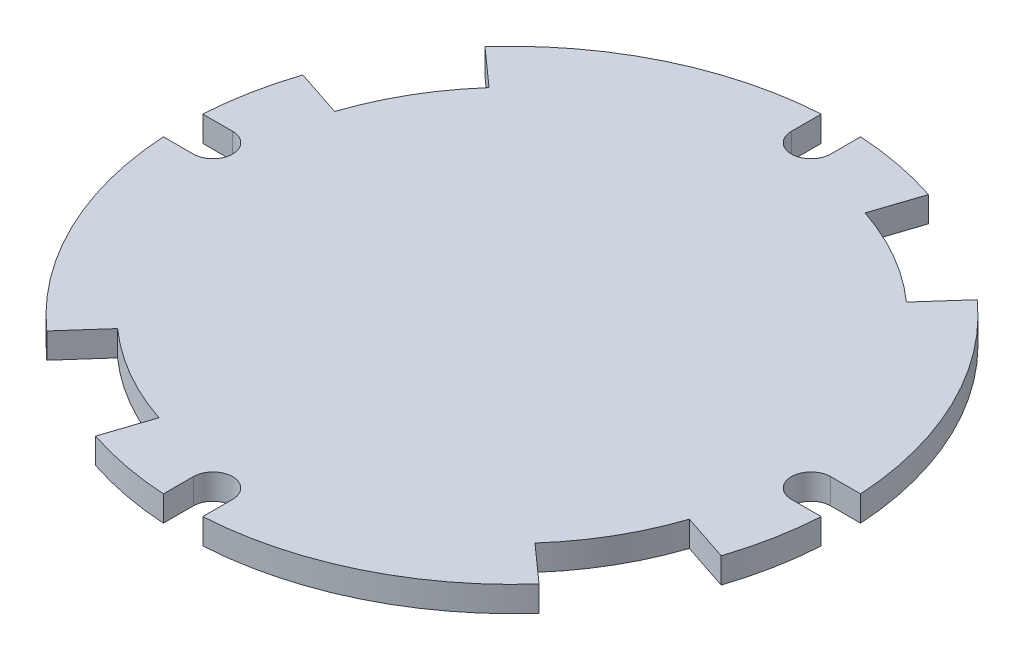
ISO-10303-21;
HEADER;
FILE_DESCRIPTION(('STEP AP214'),'2;1');
FILE_NAME('part.step','',(''),(''),'','','');
FILE_SCHEMA(('AUTOMOTIVE_DESIGN { 1 0 10303 214 1 1 1 1 }'));
ENDSEC;
DATA;
#1=APPLICATION_CONTEXT('core data for automotive mechanical design processes');
#2=APPLICATION_PROTOCOL_DEFINITION('international standard','automotive_design',2000,#1);
#3=PRODUCT_CONTEXT('',#1,'mechanical');
#4=PRODUCT('Part','Part','',(#3));
#5=PRODUCT_RELATED_PRODUCT_CATEGORY('part','',(#4));
#6=PRODUCT_DEFINITION_FORMATION('','',#4);
#7=PRODUCT_DEFINITION_CONTEXT('part definition',#1,'design');
#8=PRODUCT_DEFINITION('design','',#6,#7);
#9=PRODUCT_DEFINITION_SHAPE('','',#8);
#10=(LENGTH_UNIT() NAMED_UNIT(*) SI_UNIT(.MILLI.,.METRE.));
#11=(NAMED_UNIT(*) PLANE_ANGLE_UNIT() SI_UNIT($,.RADIAN.));
#12=(NAMED_UNIT(*) SI_UNIT($,.STERADIAN.) SOLID_ANGLE_UNIT());
#13=UNCERTAINTY_MEASURE_WITH_UNIT(LENGTH_MEASURE(1.E-05),#10,'distance_accuracy_value','');
#14=(GEOMETRIC_REPRESENTATION_CONTEXT(3) GLOBAL_UNCERTAINTY_ASSIGNED_CONTEXT((#13)) GLOBAL_UNIT_ASSIGNED_CONTEXT((#10,
#11,#12)) REPRESENTATION_CONTEXT('',''));
#15=CARTESIAN_POINT('',(0.,0.,0.));
#16=DIRECTION('',(0.,0.,1.));
#17=DIRECTION('',(1.,0.,0.));
#18=AXIS2_PLACEMENT_3D('',#15,#16,#17);
#19=CARTESIAN_POINT('',(0.,2.,0.));
#20=DIRECTION('',(0.,-1.,0.));
#21=DIRECTION('',(0.,0.,-1.));
#22=AXIS2_PLACEMENT_3D('',#19,#20,#21);
#23=CYLINDRICAL_SURFACE('',#22,25.95);
#24=DIRECTION('',(0.,-1.,0.));
#25=VECTOR('',#24,1.);
#26=CARTESIAN_POINT('',(25.9036676939772,2.,-1.55000000000027));
#27=LINE('',#26,#25);
#28=CARTESIAN_POINT('',(25.9036676939772,2.,-1.55000000000027));
#29=VERTEX_POINT('',#28);
#30=CARTESIAN_POINT('',(25.9036676939772,0.,-1.55000000000027));
#31=VERTEX_POINT('',#30);
#32=EDGE_CURVE('E406',#29,#31,#27,.T.);
#33=ORIENTED_EDGE('',*,*,#32,.T.);
#34=CARTESIAN_POINT('',(0.,0.,0.));
#35=DIRECTION('',(0.,1.,0.));
#36=DIRECTION('',(0.,0.,1.));
#37=AXIS2_PLACEMENT_3D('',#34,#35,#36);
#38=CIRCLE('',#37,25.95);
#39=CARTESIAN_POINT('',(17.2533245205966,0.,-19.3836346691476));
#40=VERTEX_POINT('',#39);
#41=EDGE_CURVE('E313',#31,#40,#38,.T.);
#42=ORIENTED_EDGE('',*,*,#41,.T.);
#43=DIRECTION('',(0.,-1.,0.));
#44=VECTOR('',#43,1.);
#45=CARTESIAN_POINT('',(17.2533245205966,2.,-19.3836346691476));
#46=LINE('',#45,#44);
#47=CARTESIAN_POINT('',(17.2533245205966,2.,-19.3836346691476));
#48=VERTEX_POINT('',#47);
#49=EDGE_CURVE('E290',#48,#40,#46,.T.);
#50=ORIENTED_EDGE('',*,*,#49,.F.);
#51=CARTESIAN_POINT('',(0.,2.,0.));
#52=DIRECTION('',(0.,1.,0.));
#53=DIRECTION('',(0.,0.,1.));
#54=AXIS2_PLACEMENT_3D('',#51,#52,#53);
#55=CIRCLE('',#54,25.95);
#56=EDGE_CURVE('E276',#29,#48,#55,.T.);
#57=ORIENTED_EDGE('',*,*,#56,.F.);
#58=EDGE_LOOP('',(#33,#42,#50,#57));
#59=FACE_BOUND('',#58,.T.);
#60=ADVANCED_FACE('F38',(#59),#23,.T.);
#61=DIRECTION('',(0.,-1.,0.));
#62=VECTOR('',#61,1.);
#63=CARTESIAN_POINT('',(25.9036676939773,2.,1.54999999999973));
#64=LINE('',#63,#62);
#65=CARTESIAN_POINT('',(25.9036676939773,2.,1.54999999999973));
#66=VERTEX_POINT('',#65);
#67=CARTESIAN_POINT('',(25.9036676939773,0.,1.54999999999973));
#68=VERTEX_POINT('',#67);
#69=EDGE_CURVE('E54',#66,#68,#64,.T.);
#70=ORIENTED_EDGE('',*,*,#69,.F.);
#71=CARTESIAN_POINT('',(24.6336346691476,2.,8.16005778085971));
#72=VERTEX_POINT('',#71);
#73=EDGE_CURVE('E269',#72,#66,#55,.T.);
#74=ORIENTED_EDGE('',*,*,#73,.F.);
#75=DIRECTION('',(0.,-1.,0.));
#76=VECTOR('',#75,1.);
#77=CARTESIAN_POINT('',(24.6336346691476,2.,8.16005778085971));
#78=LINE('',#77,#76);
#79=CARTESIAN_POINT('',(24.6336346691476,0.,8.16005778085971));
#80=VERTEX_POINT('',#79);
#81=EDGE_CURVE('E249',#72,#80,#78,.T.);
#82=ORIENTED_EDGE('',*,*,#81,.T.);
#83=EDGE_CURVE('E476',#80,#68,#38,.T.);
#84=ORIENTED_EDGE('',*,*,#83,.T.);
#85=EDGE_LOOP('',(#70,#74,#82,#84));
#86=FACE_BOUND('',#85,.T.);
#87=ADVANCED_FACE('F274',(#86),#23,.T.);
#88=DIRECTION('',(0.,-1.,0.));
#89=VECTOR('',#88,1.);
#90=CARTESIAN_POINT('',(-8.16005778085997,2.,24.6336346691475));
#91=LINE('',#90,#89);
#92=CARTESIAN_POINT('',(-8.16005778085997,2.,24.6336346691475));
#93=VERTEX_POINT('',#92);
#94=CARTESIAN_POINT('',(-8.16005778085997,0.,24.6336346691475));
#95=VERTEX_POINT('',#94);
#96=EDGE_CURVE('E379',#93,#95,#91,.T.);
#97=ORIENTED_EDGE('',*,*,#96,.T.);
#98=CARTESIAN_POINT('',(-1.55,0.,25.9036676939772));
#99=VERTEX_POINT('',#98);
#100=EDGE_CURVE('E475',#95,#99,#38,.T.);
#101=ORIENTED_EDGE('',*,*,#100,.T.);
#102=DIRECTION('',(0.,-1.,0.));
#103=VECTOR('',#102,1.);
#104=CARTESIAN_POINT('',(-1.55,2.,25.9036676939772));
#105=LINE('',#104,#103);
#106=CARTESIAN_POINT('',(-1.55,2.,25.9036676939772));
#107=VERTEX_POINT('',#106);
#108=EDGE_CURVE('E366',#107,#99,#105,.T.);
#109=ORIENTED_EDGE('',*,*,#108,.F.);
#110=EDGE_CURVE('E278',#93,#107,#55,.T.);
#111=ORIENTED_EDGE('',*,*,#110,.F.);
#112=EDGE_LOOP('',(#97,#101,#109,#111));
#113=FACE_BOUND('',#112,.T.);
#114=ADVANCED_FACE('F517',(#113),#23,.T.);
#115=DIRECTION('',(0.,-1.,0.));
#116=VECTOR('',#115,1.);
#117=CARTESIAN_POINT('',(-17.2533245205966,2.,19.3836346691476));
#118=LINE('',#117,#116);
#119=CARTESIAN_POINT('',(-17.2533245205966,2.,19.3836346691476));
#120=VERTEX_POINT('',#119);
#121=CARTESIAN_POINT('',(-17.2533245205966,0.,19.3836346691476));
#122=VERTEX_POINT('',#121);
#123=EDGE_CURVE('E434',#120,#122,#118,.T.);
#124=ORIENTED_EDGE('',*,*,#123,.F.);
#125=CARTESIAN_POINT('',(-25.9036676939772,2.,1.55000000000009));
#126=VERTEX_POINT('',#125);
#127=EDGE_CURVE('E509',#126,#120,#55,.T.);
#128=ORIENTED_EDGE('',*,*,#127,.F.);
#129=DIRECTION('',(0.,-1.,0.));
#130=VECTOR('',#129,1.);
#131=CARTESIAN_POINT('',(-25.9036676939772,2.,1.55000000000009));
#132=LINE('',#131,#130);
#133=CARTESIAN_POINT('',(-25.9036676939772,0.,1.55000000000009));
#134=VERTEX_POINT('',#133);
#135=EDGE_CURVE('E304',#126,#134,#132,.T.);
#136=ORIENTED_EDGE('',*,*,#135,.T.);
#137=EDGE_CURVE('E478',#134,#122,#38,.T.);
#138=ORIENTED_EDGE('',*,*,#137,.T.);
#139=EDGE_LOOP('',(#124,#128,#136,#138));
#140=FACE_BOUND('',#139,.T.);
#141=ADVANCED_FACE('F496',(#140),#23,.T.);
#142=DIRECTION('',(0.,-1.,0.));
#143=VECTOR('',#142,1.);
#144=CARTESIAN_POINT('',(1.55,2.,25.9036676939772));
#145=LINE('',#144,#143);
#146=CARTESIAN_POINT('',(1.55,2.,25.9036676939772));
#147=VERTEX_POINT('',#146);
#148=CARTESIAN_POINT('',(1.55,0.,25.9036676939772));
#149=VERTEX_POINT('',#148);
#150=EDGE_CURVE('E358',#147,#149,#145,.T.);
#151=ORIENTED_EDGE('',*,*,#150,.T.);
#152=CARTESIAN_POINT('',(19.3836346691478,0.,17.2533245205964));
#153=VERTEX_POINT('',#152);
#154=EDGE_CURVE('E473',#149,#153,#38,.T.);
#155=ORIENTED_EDGE('',*,*,#154,.T.);
#156=DIRECTION('',(0.,-1.,0.));
#157=VECTOR('',#156,1.);
#158=CARTESIAN_POINT('',(19.3836346691478,2.,17.2533245205964));
#159=LINE('',#158,#157);
#160=CARTESIAN_POINT('',(19.3836346691478,2.,17.2533245205964));
#161=VERTEX_POINT('',#160);
#162=EDGE_CURVE('E62',#161,#153,#159,.T.);
#163=ORIENTED_EDGE('',*,*,#162,.F.);
#164=EDGE_CURVE('E275',#147,#161,#55,.T.);
#165=ORIENTED_EDGE('',*,*,#164,.F.);
#166=EDGE_LOOP('',(#151,#155,#163,#165));
#167=FACE_BOUND('',#166,.T.);
#168=ADVANCED_FACE('F470',(#167),#23,.T.);
#169=DIRECTION('',(0.,-1.,0.));
#170=VECTOR('',#169,1.);
#171=CARTESIAN_POINT('',(-24.6336346691475,2.,-8.16005778085988));
#172=LINE('',#171,#170);
#173=CARTESIAN_POINT('',(-24.6336346691475,2.,-8.16005778085988));
#174=VERTEX_POINT('',#173);
#175=CARTESIAN_POINT('',(-24.6336346691475,0.,-8.16005778085988));
#176=VERTEX_POINT('',#175);
#177=EDGE_CURVE('E353',#174,#176,#172,.T.);
#178=ORIENTED_EDGE('',*,*,#177,.T.);
#179=CARTESIAN_POINT('',(-25.9036676939772,0.,-1.54999999999991));
#180=VERTEX_POINT('',#179);
#181=EDGE_CURVE('E483',#176,#180,#38,.T.);
#182=ORIENTED_EDGE('',*,*,#181,.T.);
#183=DIRECTION('',(0.,-1.,0.));
#184=VECTOR('',#183,1.);
#185=CARTESIAN_POINT('',(-25.9036676939772,2.,-1.54999999999991));
#186=LINE('',#185,#184);
#187=CARTESIAN_POINT('',(-25.9036676939772,2.,-1.54999999999991));
#188=VERTEX_POINT('',#187);
#189=EDGE_CURVE('E340',#188,#180,#186,.T.);
#190=ORIENTED_EDGE('',*,*,#189,.F.);
#191=EDGE_CURVE('E47',#174,#188,#55,.T.);
#192=ORIENTED_EDGE('',*,*,#191,.F.);
#193=EDGE_LOOP('',(#178,#182,#190,#192));
#194=FACE_BOUND('',#193,.T.);
#195=ADVANCED_FACE('F559',(#194),#23,.T.);
#196=DIRECTION('',(0.,-1.,0.));
#197=VECTOR('',#196,1.);
#198=CARTESIAN_POINT('',(-19.3836346691476,2.,-17.2533245205965));
#199=LINE('',#198,#197);
#200=CARTESIAN_POINT('',(-19.3836346691476,2.,-17.2533245205965));
#201=VERTEX_POINT('',#200);
#202=CARTESIAN_POINT('',(-19.3836346691476,0.,-17.2533245205965));
#203=VERTEX_POINT('',#202);
#204=EDGE_CURVE('E390',#201,#203,#199,.T.);
#205=ORIENTED_EDGE('',*,*,#204,.F.);
#206=CARTESIAN_POINT('',(-1.55,2.,-25.9036676939772));
#207=VERTEX_POINT('',#206);
#208=EDGE_CURVE('E46',#207,#201,#55,.T.);
#209=ORIENTED_EDGE('',*,*,#208,.F.);
#210=DIRECTION('',(0.,-1.,0.));
#211=VECTOR('',#210,1.);
#212=CARTESIAN_POINT('',(-1.55,2.,-25.9036676939772));
#213=LINE('',#212,#211);
#214=CARTESIAN_POINT('',(-1.55,0.,-25.9036676939772));
#215=VERTEX_POINT('',#214);
#216=EDGE_CURVE('E310',#207,#215,#213,.T.);
#217=ORIENTED_EDGE('',*,*,#216,.T.);
#218=EDGE_CURVE('E41',#215,#203,#38,.T.);
#219=ORIENTED_EDGE('',*,*,#218,.T.);
#220=EDGE_LOOP('',(#205,#209,#217,#219));
#221=FACE_BOUND('',#220,.T.);
#222=ADVANCED_FACE('F549',(#221),#23,.T.);
#223=CARTESIAN_POINT('',(0.,2.,0.));
#224=DIRECTION('',(0.,1.,0.));
#225=DIRECTION('',(0.,0.,1.));
#226=AXIS2_PLACEMENT_3D('',#223,#224,#225);
#227=PLANE('',#226);
#228=CARTESIAN_POINT('',(23.55,2.,-2.46070496348907E-13));
#229=DIRECTION('',(0.,1.,0.));
#230=DIRECTION('',(-1.,0.,0.));
#231=AXIS2_PLACEMENT_3D('',#228,#229,#230);
#232=CIRCLE('',#231,1.55);
#233=CARTESIAN_POINT('',(23.55,2.,-1.55000000000025));
#234=VERTEX_POINT('',#233);
#235=CARTESIAN_POINT('',(23.55,2.,1.54999999999975));
#236=VERTEX_POINT('',#235);
#237=EDGE_CURVE('E425',#234,#236,#232,.T.);
#238=ORIENTED_EDGE('',*,*,#237,.F.);
#239=DIRECTION('',(-1.,0.,0.));
#240=VECTOR('',#239,1.);
#241=CARTESIAN_POINT('',(25.9036676939772,2.,-1.55000000000027));
#242=LINE('',#241,#240);
#243=EDGE_CURVE('E418',#29,#234,#242,.T.);
#244=ORIENTED_EDGE('',*,*,#243,.F.);
#245=ORIENTED_EDGE('',*,*,#56,.T.);
#246=DIRECTION('',(0.664867996940139,0.,-0.746960873570234));
#247=VECTOR('',#246,1.);
#248=CARTESIAN_POINT('',(17.2533245205966,2.,-19.3836346691476));
#249=LINE('',#248,#247);
#250=CARTESIAN_POINT('',(14.6270959326831,2.,-16.4331392185452));
#251=VERTEX_POINT('',#250);
#252=EDGE_CURVE('E293',#251,#48,#249,.T.);
#253=ORIENTED_EDGE('',*,*,#252,.F.);
#254=CARTESIAN_POINT('',(0.,2.,0.));
#255=DIRECTION('',(0.,-1.,0.));
#256=DIRECTION('',(0.,0.,1.));
#257=AXIS2_PLACEMENT_3D('',#254,#255,#256);
#258=CIRCLE('',#257,22.);
#259=CARTESIAN_POINT('',(6.91796806084467,2.,-20.8840062705682));
#260=VERTEX_POINT('',#259);
#261=EDGE_CURVE('E307',#260,#251,#258,.T.);
#262=ORIENTED_EDGE('',*,*,#261,.F.);
#263=DIRECTION('',(-0.314453093674758,0.,0.949273012298556));
#264=VECTOR('',#263,1.);
#265=CARTESIAN_POINT('',(8.16005778085997,2.,-24.6336346691475));
#266=LINE('',#265,#264);
#267=CARTESIAN_POINT('',(8.16005778085997,2.,-24.6336346691475));
#268=VERTEX_POINT('',#267);
#269=EDGE_CURVE('E297',#268,#260,#266,.T.);
#270=ORIENTED_EDGE('',*,*,#269,.F.);
#271=CARTESIAN_POINT('',(1.55,2.,-25.9036676939772));
#272=VERTEX_POINT('',#271);
#273=EDGE_CURVE('E11',#268,#272,#55,.T.);
#274=ORIENTED_EDGE('',*,*,#273,.T.);
#275=DIRECTION('',(0.,0.,-1.));
#276=VECTOR('',#275,1.);
#277=CARTESIAN_POINT('',(1.55,2.,-25.9036676939772));
#278=LINE('',#277,#276);
#279=CARTESIAN_POINT('',(1.55,2.,-23.55));
#280=VERTEX_POINT('',#279);
#281=EDGE_CURVE('E320',#280,#272,#278,.T.);
#282=ORIENTED_EDGE('',*,*,#281,.F.);
#283=CARTESIAN_POINT('',(0.,2.,-23.55));
#284=DIRECTION('',(0.,1.,0.));
#285=DIRECTION('',(0.,0.,1.));
#286=AXIS2_PLACEMENT_3D('',#283,#284,#285);
#287=CIRCLE('',#286,1.55);
#288=CARTESIAN_POINT('',(-1.55,2.,-23.55));
#289=VERTEX_POINT('',#288);
#290=EDGE_CURVE('E331',#289,#280,#287,.T.);
#291=ORIENTED_EDGE('',*,*,#290,.F.);
#292=DIRECTION('',(0.,0.,1.));
#293=VECTOR('',#292,1.);
#294=CARTESIAN_POINT('',(-1.55,2.,-25.9036676939772));
#295=LINE('',#294,#293);
#296=EDGE_CURVE('E324',#207,#289,#295,.T.);
#297=ORIENTED_EDGE('',*,*,#296,.F.);
#298=ORIENTED_EDGE('',*,*,#208,.T.);
#299=DIRECTION('',(-0.746960873570237,0.,-0.664867996940136));
#300=VECTOR('',#299,1.);
#301=CARTESIAN_POINT('',(-19.3836346691476,2.,-17.2533245205965));
#302=LINE('',#301,#300);
#303=CARTESIAN_POINT('',(-16.4331392185452,2.,-14.627095932683));
#304=VERTEX_POINT('',#303);
#305=EDGE_CURVE('E392',#304,#201,#302,.T.);
#306=ORIENTED_EDGE('',*,*,#305,.F.);
#307=CARTESIAN_POINT('',(0.,2.,0.));
#308=DIRECTION('',(0.,-1.,0.));
#309=DIRECTION('',(1.,0.,0.));
#310=AXIS2_PLACEMENT_3D('',#307,#308,#309);
#311=CIRCLE('',#310,22.);
#312=CARTESIAN_POINT('',(-20.8840062705683,2.,-6.9179680608446));
#313=VERTEX_POINT('',#312);
#314=EDGE_CURVE('E403',#313,#304,#311,.T.);
#315=ORIENTED_EDGE('',*,*,#314,.F.);
#316=DIRECTION('',(0.949273012298557,0.,0.314453093674755));
#317=VECTOR('',#316,1.);
#318=CARTESIAN_POINT('',(-24.6336346691475,2.,-8.16005778085988));
#319=LINE('',#318,#317);
#320=EDGE_CURVE('E396',#174,#313,#319,.T.);
#321=ORIENTED_EDGE('',*,*,#320,.F.);
#322=ORIENTED_EDGE('',*,*,#191,.T.);
#323=DIRECTION('',(-1.,0.,0.));
#324=VECTOR('',#323,1.);
#325=CARTESIAN_POINT('',(-25.9036676939772,2.,-1.54999999999991));
#326=LINE('',#325,#324);
#327=CARTESIAN_POINT('',(-23.55,2.,-1.54999999999992));
#328=VERTEX_POINT('',#327);
#329=EDGE_CURVE('E342',#328,#188,#326,.T.);
#330=ORIENTED_EDGE('',*,*,#329,.F.);
#331=CARTESIAN_POINT('',(-23.55,2.,0.));
#332=DIRECTION('',(0.,1.,0.));
#333=DIRECTION('',(1.,0.,0.));
#334=AXIS2_PLACEMENT_3D('',#331,#332,#333);
#335=CIRCLE('',#334,1.55);
#336=CARTESIAN_POINT('',(-23.55,2.,1.55000000000008));
#337=VERTEX_POINT('',#336);
#338=EDGE_CURVE('E355',#337,#328,#335,.T.);
#339=ORIENTED_EDGE('',*,*,#338,.F.);
#340=DIRECTION('',(1.,0.,0.));
#341=VECTOR('',#340,1.);
#342=CARTESIAN_POINT('',(-25.9036676939772,2.,1.55000000000009));
#343=LINE('',#342,#341);
#344=EDGE_CURVE('E346',#126,#337,#343,.T.);
#345=ORIENTED_EDGE('',*,*,#344,.F.);
#346=ORIENTED_EDGE('',*,*,#127,.T.);
#347=DIRECTION('',(-0.664867996940139,0.,0.746960873570234));
#348=VECTOR('',#347,1.);
#349=CARTESIAN_POINT('',(-17.2533245205966,2.,19.3836346691476));
#350=LINE('',#349,#348);
#351=CARTESIAN_POINT('',(-14.6270959326831,2.,16.4331392185452));
#352=VERTEX_POINT('',#351);
#353=EDGE_CURVE('E436',#352,#120,#350,.T.);
#354=ORIENTED_EDGE('',*,*,#353,.F.);
#355=CARTESIAN_POINT('',(0.,2.,0.));
#356=DIRECTION('',(0.,-1.,0.));
#357=DIRECTION('',(0.,0.,-1.));
#358=AXIS2_PLACEMENT_3D('',#355,#356,#357);
#359=CIRCLE('',#358,22.);
#360=CARTESIAN_POINT('',(-6.91796806084467,2.,20.8840062705682));
#361=VERTEX_POINT('',#360);
#362=EDGE_CURVE('E447',#361,#352,#359,.T.);
#363=ORIENTED_EDGE('',*,*,#362,.F.);
#364=DIRECTION('',(0.314453093674758,0.,-0.949273012298556));
#365=VECTOR('',#364,1.);
#366=CARTESIAN_POINT('',(-8.16005778085997,2.,24.6336346691475));
#367=LINE('',#366,#365);
#368=EDGE_CURVE('E440',#93,#361,#367,.T.);
#369=ORIENTED_EDGE('',*,*,#368,.F.);
#370=ORIENTED_EDGE('',*,*,#110,.T.);
#371=DIRECTION('',(0.,0.,1.));
#372=VECTOR('',#371,1.);
#373=CARTESIAN_POINT('',(-1.55,2.,25.9036676939772));
#374=LINE('',#373,#372);
#375=CARTESIAN_POINT('',(-1.55,2.,23.55));
#376=VERTEX_POINT('',#375);
#377=EDGE_CURVE('E368',#376,#107,#374,.T.);
#378=ORIENTED_EDGE('',*,*,#377,.F.);
#379=CARTESIAN_POINT('',(0.,2.,23.55));
#380=DIRECTION('',(0.,1.,0.));
#381=DIRECTION('',(0.,0.,-1.));
#382=AXIS2_PLACEMENT_3D('',#379,#380,#381);
#383=CIRCLE('',#382,1.55);
#384=CARTESIAN_POINT('',(1.55,2.,23.55));
#385=VERTEX_POINT('',#384);
#386=EDGE_CURVE('E381',#385,#376,#383,.T.);
#387=ORIENTED_EDGE('',*,*,#386,.F.);
#388=DIRECTION('',(0.,0.,-1.));
#389=VECTOR('',#388,1.);
#390=CARTESIAN_POINT('',(1.55,2.,25.9036676939772));
#391=LINE('',#390,#389);
#392=EDGE_CURVE('E372',#147,#385,#391,.T.);
#393=ORIENTED_EDGE('',*,*,#392,.F.);
#394=ORIENTED_EDGE('',*,*,#164,.T.);
#395=DIRECTION('',(0.746960873570241,0.,0.664867996940131));
#396=VECTOR('',#395,1.);
#397=CARTESIAN_POINT('',(19.3836346691478,2.,17.2533245205964));
#398=LINE('',#397,#396);
#399=CARTESIAN_POINT('',(16.4331392185453,2.,14.6270959326829));
#400=VERTEX_POINT('',#399);
#401=EDGE_CURVE('E454',#400,#161,#398,.T.);
#402=ORIENTED_EDGE('',*,*,#401,.F.);
#403=CARTESIAN_POINT('',(0.,2.,0.));
#404=DIRECTION('',(0.,-1.,0.));
#405=DIRECTION('',(-1.,0.,0.));
#406=AXIS2_PLACEMENT_3D('',#403,#404,#405);
#407=CIRCLE('',#406,22.);
#408=CARTESIAN_POINT('',(20.8840062705683,2.,6.91796806084445));
#409=VERTEX_POINT('',#408);
#410=EDGE_CURVE('E271',#409,#400,#407,.T.);
#411=ORIENTED_EDGE('',*,*,#410,.F.);
#412=DIRECTION('',(-0.949273012298559,0.,-0.314453093674748));
#413=VECTOR('',#412,1.);
#414=CARTESIAN_POINT('',(24.6336346691476,2.,8.16005778085971));
#415=LINE('',#414,#413);
#416=EDGE_CURVE('E252',#72,#409,#415,.T.);
#417=ORIENTED_EDGE('',*,*,#416,.F.);
#418=ORIENTED_EDGE('',*,*,#73,.T.);
#419=DIRECTION('',(1.,0.,0.));
#420=VECTOR('',#419,1.);
#421=CARTESIAN_POINT('',(25.9036676939773,2.,1.54999999999973));
#422=LINE('',#421,#420);
#423=EDGE_CURVE('E415',#236,#66,#422,.T.);
#424=ORIENTED_EDGE('',*,*,#423,.F.);
#425=EDGE_LOOP('',(#238,#244,#245,#253,#262,#270,#274,#282,#291,#297,#298,#306,#315,#321,#322,
#330,#339,#345,#346,#354,#363,#369,#370,#378,#387,#393,#394,#402,#411,#417,#418,#424));
#426=FACE_BOUND('',#425,.T.);
#427=ADVANCED_FACE('F267',(#426),#227,.T.);
#428=CARTESIAN_POINT('',(0.,0.,0.));
#429=DIRECTION('',(0.,1.,0.));
#430=DIRECTION('',(0.,0.,1.));
#431=AXIS2_PLACEMENT_3D('',#428,#429,#430);
#432=PLANE('',#431);
#433=DIRECTION('',(-1.,0.,0.));
#434=VECTOR('',#433,1.);
#435=CARTESIAN_POINT('',(25.9036676939772,0.,-1.55000000000027));
#436=LINE('',#435,#434);
#437=CARTESIAN_POINT('',(23.55,0.,-1.55000000000025));
#438=VERTEX_POINT('',#437);
#439=EDGE_CURVE('E260',#31,#438,#436,.T.);
#440=ORIENTED_EDGE('',*,*,#439,.T.);
#441=CARTESIAN_POINT('',(23.55,0.,-2.46070496348907E-13));
#442=DIRECTION('',(0.,1.,0.));
#443=DIRECTION('',(-1.,0.,0.));
#444=AXIS2_PLACEMENT_3D('',#441,#442,#443);
#445=CIRCLE('',#444,1.55);
#446=CARTESIAN_POINT('',(23.55,0.,1.54999999999975));
#447=VERTEX_POINT('',#446);
#448=EDGE_CURVE('E419',#438,#447,#445,.T.);
#449=ORIENTED_EDGE('',*,*,#448,.T.);
#450=DIRECTION('',(1.,0.,0.));
#451=VECTOR('',#450,1.);
#452=CARTESIAN_POINT('',(25.9036676939773,0.,1.54999999999973));
#453=LINE('',#452,#451);
#454=EDGE_CURVE('E416',#447,#68,#453,.T.);
#455=ORIENTED_EDGE('',*,*,#454,.T.);
#456=ORIENTED_EDGE('',*,*,#83,.F.);
#457=DIRECTION('',(-0.949273012298559,0.,-0.314453093674748));
#458=VECTOR('',#457,1.);
#459=CARTESIAN_POINT('',(24.6336346691476,0.,8.16005778085971));
#460=LINE('',#459,#458);
#461=CARTESIAN_POINT('',(20.8840062705683,0.,6.91796806084445));
#462=VERTEX_POINT('',#461);
#463=EDGE_CURVE('E255',#80,#462,#460,.T.);
#464=ORIENTED_EDGE('',*,*,#463,.T.);
#465=CARTESIAN_POINT('',(0.,0.,0.));
#466=DIRECTION('',(0.,-1.,0.));
#467=DIRECTION('',(-1.,0.,0.));
#468=AXIS2_PLACEMENT_3D('',#465,#466,#467);
#469=CIRCLE('',#468,22.);
#470=CARTESIAN_POINT('',(16.4331392185453,0.,14.6270959326829));
#471=VERTEX_POINT('',#470);
#472=EDGE_CURVE('E456',#462,#471,#469,.T.);
#473=ORIENTED_EDGE('',*,*,#472,.T.);
#474=DIRECTION('',(0.746960873570241,0.,0.664867996940131));
#475=VECTOR('',#474,1.);
#476=CARTESIAN_POINT('',(19.3836346691478,0.,17.2533245205964));
#477=LINE('',#476,#475);
#478=EDGE_CURVE('E272',#471,#153,#477,.T.);
#479=ORIENTED_EDGE('',*,*,#478,.T.);
#480=ORIENTED_EDGE('',*,*,#154,.F.);
#481=DIRECTION('',(0.,0.,-1.));
#482=VECTOR('',#481,1.);
#483=CARTESIAN_POINT('',(1.55,0.,25.9036676939772));
#484=LINE('',#483,#482);
#485=CARTESIAN_POINT('',(1.55,0.,23.55));
#486=VERTEX_POINT('',#485);
#487=EDGE_CURVE('E376',#149,#486,#484,.T.);
#488=ORIENTED_EDGE('',*,*,#487,.T.);
#489=CARTESIAN_POINT('',(0.,0.,23.55));
#490=DIRECTION('',(0.,1.,0.));
#491=DIRECTION('',(0.,0.,-1.));
#492=AXIS2_PLACEMENT_3D('',#489,#490,#491);
#493=CIRCLE('',#492,1.55);
#494=CARTESIAN_POINT('',(-1.55,0.,23.55));
#495=VERTEX_POINT('',#494);
#496=EDGE_CURVE('E373',#486,#495,#493,.T.);
#497=ORIENTED_EDGE('',*,*,#496,.T.);
#498=DIRECTION('',(0.,0.,1.));
#499=VECTOR('',#498,1.);
#500=CARTESIAN_POINT('',(-1.55,0.,25.9036676939772));
#501=LINE('',#500,#499);
#502=EDGE_CURVE('E369',#495,#99,#501,.T.);
#503=ORIENTED_EDGE('',*,*,#502,.T.);
#504=ORIENTED_EDGE('',*,*,#100,.F.);
#505=DIRECTION('',(0.314453093674758,0.,-0.949273012298556));
#506=VECTOR('',#505,1.);
#507=CARTESIAN_POINT('',(-8.16005778085997,0.,24.6336346691475));
#508=LINE('',#507,#506);
#509=CARTESIAN_POINT('',(-6.91796806084467,0.,20.8840062705682));
#510=VERTEX_POINT('',#509);
#511=EDGE_CURVE('E409',#95,#510,#508,.T.);
#512=ORIENTED_EDGE('',*,*,#511,.T.);
#513=CARTESIAN_POINT('',(0.,0.,0.));
#514=DIRECTION('',(0.,-1.,0.));
#515=DIRECTION('',(0.,0.,-1.));
#516=AXIS2_PLACEMENT_3D('',#513,#514,#515);
#517=CIRCLE('',#516,22.);
#518=CARTESIAN_POINT('',(-14.6270959326831,0.,16.4331392185452));
#519=VERTEX_POINT('',#518);
#520=EDGE_CURVE('E441',#510,#519,#517,.T.);
#521=ORIENTED_EDGE('',*,*,#520,.T.);
#522=DIRECTION('',(-0.664867996940139,0.,0.746960873570234));
#523=VECTOR('',#522,1.);
#524=CARTESIAN_POINT('',(-17.2533245205966,0.,19.3836346691476));
#525=LINE('',#524,#523);
#526=EDGE_CURVE('E437',#519,#122,#525,.T.);
#527=ORIENTED_EDGE('',*,*,#526,.T.);
#528=ORIENTED_EDGE('',*,*,#137,.F.);
#529=DIRECTION('',(1.,0.,0.));
#530=VECTOR('',#529,1.);
#531=CARTESIAN_POINT('',(-25.9036676939772,0.,1.55000000000009));
#532=LINE('',#531,#530);
#533=CARTESIAN_POINT('',(-23.55,0.,1.55000000000008));
#534=VERTEX_POINT('',#533);
#535=EDGE_CURVE('E350',#134,#534,#532,.T.);
#536=ORIENTED_EDGE('',*,*,#535,.T.);
#537=CARTESIAN_POINT('',(-23.55,0.,0.));
#538=DIRECTION('',(0.,1.,0.));
#539=DIRECTION('',(1.,0.,0.));
#540=AXIS2_PLACEMENT_3D('',#537,#538,#539);
#541=CIRCLE('',#540,1.55);
#542=CARTESIAN_POINT('',(-23.55,0.,-1.54999999999992));
#543=VERTEX_POINT('',#542);
#544=EDGE_CURVE('E347',#534,#543,#541,.T.);
#545=ORIENTED_EDGE('',*,*,#544,.T.);
#546=DIRECTION('',(-1.,0.,0.));
#547=VECTOR('',#546,1.);
#548=CARTESIAN_POINT('',(-25.9036676939772,0.,-1.54999999999991));
#549=LINE('',#548,#547);
#550=EDGE_CURVE('E343',#543,#180,#549,.T.);
#551=ORIENTED_EDGE('',*,*,#550,.T.);
#552=ORIENTED_EDGE('',*,*,#181,.F.);
#553=DIRECTION('',(0.949273012298557,0.,0.314453093674755));
#554=VECTOR('',#553,1.);
#555=CARTESIAN_POINT('',(-24.6336346691475,0.,-8.16005778085988));
#556=LINE('',#555,#554);
#557=CARTESIAN_POINT('',(-20.8840062705683,0.,-6.9179680608446));
#558=VERTEX_POINT('',#557);
#559=EDGE_CURVE('E361',#176,#558,#556,.T.);
#560=ORIENTED_EDGE('',*,*,#559,.T.);
#561=CARTESIAN_POINT('',(0.,0.,0.));
#562=DIRECTION('',(0.,-1.,0.));
#563=DIRECTION('',(1.,0.,0.));
#564=AXIS2_PLACEMENT_3D('',#561,#562,#563);
#565=CIRCLE('',#564,22.);
#566=CARTESIAN_POINT('',(-16.4331392185452,0.,-14.627095932683));
#567=VERTEX_POINT('',#566);
#568=EDGE_CURVE('E397',#558,#567,#565,.T.);
#569=ORIENTED_EDGE('',*,*,#568,.T.);
#570=DIRECTION('',(-0.746960873570237,0.,-0.664867996940136));
#571=VECTOR('',#570,1.);
#572=CARTESIAN_POINT('',(-19.3836346691476,0.,-17.2533245205965));
#573=LINE('',#572,#571);
#574=EDGE_CURVE('E393',#567,#203,#573,.T.);
#575=ORIENTED_EDGE('',*,*,#574,.T.);
#576=ORIENTED_EDGE('',*,*,#218,.F.);
#577=DIRECTION('',(0.,0.,1.));
#578=VECTOR('',#577,1.);
#579=CARTESIAN_POINT('',(-1.55,0.,-25.9036676939772));
#580=LINE('',#579,#578);
#581=CARTESIAN_POINT('',(-1.55,0.,-23.55));
#582=VERTEX_POINT('',#581);
#583=EDGE_CURVE('E285',#215,#582,#580,.T.);
#584=ORIENTED_EDGE('',*,*,#583,.T.);
#585=CARTESIAN_POINT('',(0.,0.,-23.55));
#586=DIRECTION('',(0.,1.,0.));
#587=DIRECTION('',(0.,0.,1.));
#588=AXIS2_PLACEMENT_3D('',#585,#586,#587);
#589=CIRCLE('',#588,1.55);
#590=CARTESIAN_POINT('',(1.55,0.,-23.55));
#591=VERTEX_POINT('',#590);
#592=EDGE_CURVE('E325',#582,#591,#589,.T.);
#593=ORIENTED_EDGE('',*,*,#592,.T.);
#594=DIRECTION('',(0.,0.,-1.));
#595=VECTOR('',#594,1.);
#596=CARTESIAN_POINT('',(1.55,0.,-25.9036676939772));
#597=LINE('',#596,#595);
#598=CARTESIAN_POINT('',(1.55,0.,-25.9036676939772));
#599=VERTEX_POINT('',#598);
#600=EDGE_CURVE('E321',#591,#599,#597,.T.);
#601=ORIENTED_EDGE('',*,*,#600,.T.);
#602=CARTESIAN_POINT('',(8.16005778085997,0.,-24.6336346691475));
#603=VERTEX_POINT('',#602);
#604=EDGE_CURVE('E279',#603,#599,#38,.T.);
#605=ORIENTED_EDGE('',*,*,#604,.F.);
#606=DIRECTION('',(-0.314453093674758,0.,0.949273012298556));
#607=VECTOR('',#606,1.);
#608=CARTESIAN_POINT('',(8.16005778085997,0.,-24.6336346691475));
#609=LINE('',#608,#607);
#610=CARTESIAN_POINT('',(6.91796806084467,0.,-20.8840062705682));
#611=VERTEX_POINT('',#610);
#612=EDGE_CURVE('E301',#603,#611,#609,.T.);
#613=ORIENTED_EDGE('',*,*,#612,.T.);
#614=CARTESIAN_POINT('',(0.,0.,0.));
#615=DIRECTION('',(0.,-1.,0.));
#616=DIRECTION('',(0.,0.,1.));
#617=AXIS2_PLACEMENT_3D('',#614,#615,#616);
#618=CIRCLE('',#617,22.);
#619=CARTESIAN_POINT('',(14.6270959326831,0.,-16.4331392185452));
#620=VERTEX_POINT('',#619);
#621=EDGE_CURVE('E298',#611,#620,#618,.T.);
#622=ORIENTED_EDGE('',*,*,#621,.T.);
#623=DIRECTION('',(0.664867996940139,0.,-0.746960873570234));
#624=VECTOR('',#623,1.);
#625=CARTESIAN_POINT('',(17.2533245205966,0.,-19.3836346691476));
#626=LINE('',#625,#624);
#627=EDGE_CURVE('E294',#620,#40,#626,.T.);
#628=ORIENTED_EDGE('',*,*,#627,.T.);
#629=ORIENTED_EDGE('',*,*,#41,.F.);
#630=EDGE_LOOP('',(#440,#449,#455,#456,#464,#473,#479,#480,#488,#497,#503,#504,#512,#521,#527,
#528,#536,#545,#551,#552,#560,#569,#575,#576,#584,#593,#601,#605,#613,#622,#628,#629));
#631=FACE_BOUND('',#630,.T.);
#632=ADVANCED_FACE('F499',(#631),#432,.F.);
#633=DIRECTION('',(0.,-1.,0.));
#634=VECTOR('',#633,1.);
#635=CARTESIAN_POINT('',(1.55,2.,-25.9036676939772));
#636=LINE('',#635,#634);
#637=EDGE_CURVE('E318',#272,#599,#636,.T.);
#638=ORIENTED_EDGE('',*,*,#637,.F.);
#639=ORIENTED_EDGE('',*,*,#273,.F.);
#640=DIRECTION('',(0.,-1.,0.));
#641=VECTOR('',#640,1.);
#642=CARTESIAN_POINT('',(8.16005778085997,2.,-24.6336346691475));
#643=LINE('',#642,#641);
#644=EDGE_CURVE('E282',#268,#603,#643,.T.);
#645=ORIENTED_EDGE('',*,*,#644,.T.);
#646=ORIENTED_EDGE('',*,*,#604,.T.);
#647=EDGE_LOOP('',(#638,#639,#645,#646));
#648=FACE_BOUND('',#647,.T.);
#649=ADVANCED_FACE('F542',(#648),#23,.T.);
#650=CARTESIAN_POINT('',(8.16005778085997,2.,-24.6336346691475));
#651=DIRECTION('',(0.949273012298556,0.,0.314453093674758));
#652=DIRECTION('',(0.314453093674758,0.,-0.949273012298556));
#653=AXIS2_PLACEMENT_3D('',#650,#651,#652);
#654=PLANE('',#653);
#655=ORIENTED_EDGE('',*,*,#612,.F.);
#656=ORIENTED_EDGE('',*,*,#644,.F.);
#657=ORIENTED_EDGE('',*,*,#269,.T.);
#658=DIRECTION('',(0.,-1.,0.));
#659=VECTOR('',#658,1.);
#660=CARTESIAN_POINT('',(6.91796806084467,2.,-20.8840062705682));
#661=LINE('',#660,#659);
#662=EDGE_CURVE('E286',#260,#611,#661,.T.);
#663=ORIENTED_EDGE('',*,*,#662,.T.);
#664=EDGE_LOOP('',(#655,#656,#657,#663));
#665=FACE_BOUND('',#664,.T.);
#666=ADVANCED_FACE('F547',(#665),#654,.T.);
#667=CARTESIAN_POINT('',(0.,2.,0.));
#668=DIRECTION('',(0.,-1.,0.));
#669=DIRECTION('',(0.,0.,-1.));
#670=AXIS2_PLACEMENT_3D('',#667,#668,#669);
#671=CYLINDRICAL_SURFACE('',#670,22.);
#672=ORIENTED_EDGE('',*,*,#621,.F.);
#673=ORIENTED_EDGE('',*,*,#662,.F.);
#674=ORIENTED_EDGE('',*,*,#261,.T.);
#675=DIRECTION('',(0.,-1.,0.));
#676=VECTOR('',#675,1.);
#677=CARTESIAN_POINT('',(14.6270959326831,2.,-16.4331392185452));
#678=LINE('',#677,#676);
#679=EDGE_CURVE('E288',#251,#620,#678,.T.);
#680=ORIENTED_EDGE('',*,*,#679,.T.);
#681=EDGE_LOOP('',(#672,#673,#674,#680));
#682=FACE_BOUND('',#681,.T.);
#683=ADVANCED_FACE('F554',(#682),#671,.T.);
#684=CARTESIAN_POINT('',(17.2533245205966,2.,-19.3836346691476));
#685=DIRECTION('',(-0.746960873570234,0.,-0.664867996940139));
#686=DIRECTION('',(-0.664867996940139,0.,0.746960873570234));
#687=AXIS2_PLACEMENT_3D('',#684,#685,#686);
#688=PLANE('',#687);
#689=ORIENTED_EDGE('',*,*,#627,.F.);
#690=ORIENTED_EDGE('',*,*,#679,.F.);
#691=ORIENTED_EDGE('',*,*,#252,.T.);
#692=ORIENTED_EDGE('',*,*,#49,.T.);
#693=EDGE_LOOP('',(#689,#690,#691,#692));
#694=FACE_BOUND('',#693,.T.);
#695=ADVANCED_FACE('F613',(#694),#688,.T.);
#696=CARTESIAN_POINT('',(-1.55,2.,-25.9036676939772));
#697=DIRECTION('',(1.,0.,0.));
#698=DIRECTION('',(0.,0.,-1.));
#699=AXIS2_PLACEMENT_3D('',#696,#697,#698);
#700=PLANE('',#699);
#701=ORIENTED_EDGE('',*,*,#583,.F.);
#702=ORIENTED_EDGE('',*,*,#216,.F.);
#703=ORIENTED_EDGE('',*,*,#296,.T.);
#704=DIRECTION('',(0.,-1.,0.));
#705=VECTOR('',#704,1.);
#706=CARTESIAN_POINT('',(-1.55,2.,-23.55));
#707=LINE('',#706,#705);
#708=EDGE_CURVE('E314',#289,#582,#707,.T.);
#709=ORIENTED_EDGE('',*,*,#708,.T.);
#710=EDGE_LOOP('',(#701,#702,#703,#709));
#711=FACE_BOUND('',#710,.T.);
#712=ADVANCED_FACE('F574',(#711),#700,.T.);
#713=CARTESIAN_POINT('',(0.,2.,-23.55));
#714=DIRECTION('',(0.,-1.,0.));
#715=DIRECTION('',(0.,0.,-1.));
#716=AXIS2_PLACEMENT_3D('',#713,#714,#715);
#717=CYLINDRICAL_SURFACE('',#716,1.55);
#718=ORIENTED_EDGE('',*,*,#592,.F.);
#719=ORIENTED_EDGE('',*,*,#708,.F.);
#720=ORIENTED_EDGE('',*,*,#290,.T.);
#721=DIRECTION('',(0.,-1.,0.));
#722=VECTOR('',#721,1.);
#723=CARTESIAN_POINT('',(1.55,2.,-23.55));
#724=LINE('',#723,#722);
#725=EDGE_CURVE('E316',#280,#591,#724,.T.);
#726=ORIENTED_EDGE('',*,*,#725,.T.);
#727=EDGE_LOOP('',(#718,#719,#720,#726));
#728=FACE_BOUND('',#727,.T.);
#729=ADVANCED_FACE('F577',(#728),#717,.F.);
#730=CARTESIAN_POINT('',(1.55,2.,-25.9036676939772));
#731=DIRECTION('',(-1.,0.,0.));
#732=DIRECTION('',(0.,0.,1.));
#733=AXIS2_PLACEMENT_3D('',#730,#731,#732);
#734=PLANE('',#733);
#735=ORIENTED_EDGE('',*,*,#600,.F.);
#736=ORIENTED_EDGE('',*,*,#725,.F.);
#737=ORIENTED_EDGE('',*,*,#281,.T.);
#738=ORIENTED_EDGE('',*,*,#637,.T.);
#739=EDGE_LOOP('',(#735,#736,#737,#738));
#740=FACE_BOUND('',#739,.T.);
#741=ADVANCED_FACE('F599',(#740),#734,.T.);
#742=CARTESIAN_POINT('',(-25.9036676939772,2.,1.55000000000009));
#743=DIRECTION('',(0.,0.,-1.));
#744=DIRECTION('',(-1.,0.,0.));
#745=AXIS2_PLACEMENT_3D('',#742,#743,#744);
#746=PLANE('',#745);
#747=ORIENTED_EDGE('',*,*,#535,.F.);
#748=ORIENTED_EDGE('',*,*,#135,.F.);
#749=ORIENTED_EDGE('',*,*,#344,.T.);
#750=DIRECTION('',(0.,-1.,0.));
#751=VECTOR('',#750,1.);
#752=CARTESIAN_POINT('',(-23.55,2.,1.55000000000008));
#753=LINE('',#752,#751);
#754=EDGE_CURVE('E336',#337,#534,#753,.T.);
#755=ORIENTED_EDGE('',*,*,#754,.T.);
#756=EDGE_LOOP('',(#747,#748,#749,#755));
#757=FACE_BOUND('',#756,.T.);
#758=ADVANCED_FACE('F597',(#757),#746,.T.);
#759=CARTESIAN_POINT('',(-23.55,2.,0.));
#760=DIRECTION('',(0.,-1.,0.));
#761=DIRECTION('',(0.,0.,-1.));
#762=AXIS2_PLACEMENT_3D('',#759,#760,#761);
#763=CYLINDRICAL_SURFACE('',#762,1.55);
#764=ORIENTED_EDGE('',*,*,#544,.F.);
#765=ORIENTED_EDGE('',*,*,#754,.F.);
#766=ORIENTED_EDGE('',*,*,#338,.T.);
#767=DIRECTION('',(0.,-1.,0.));
#768=VECTOR('',#767,1.);
#769=CARTESIAN_POINT('',(-23.55,2.,-1.54999999999992));
#770=LINE('',#769,#768);
#771=EDGE_CURVE('E338',#328,#543,#770,.T.);
#772=ORIENTED_EDGE('',*,*,#771,.T.);
#773=EDGE_LOOP('',(#764,#765,#766,#772));
#774=FACE_BOUND('',#773,.T.);
#775=ADVANCED_FACE('F595',(#774),#763,.F.);
#776=CARTESIAN_POINT('',(-25.9036676939772,2.,-1.54999999999991));
#777=DIRECTION('',(0.,0.,1.));
#778=DIRECTION('',(1.,0.,0.));
#779=AXIS2_PLACEMENT_3D('',#776,#777,#778);
#780=PLANE('',#779);
#781=ORIENTED_EDGE('',*,*,#550,.F.);
#782=ORIENTED_EDGE('',*,*,#771,.F.);
#783=ORIENTED_EDGE('',*,*,#329,.T.);
#784=ORIENTED_EDGE('',*,*,#189,.T.);
#785=EDGE_LOOP('',(#781,#782,#783,#784));
#786=FACE_BOUND('',#785,.T.);
#787=ADVANCED_FACE('F590',(#786),#780,.T.);
#788=CARTESIAN_POINT('',(24.6336346691476,2.,8.16005778085971));
#789=DIRECTION('',(-0.314453093674748,0.,0.949273012298559));
#790=DIRECTION('',(0.949273012298559,0.,0.314453093674748));
#791=AXIS2_PLACEMENT_3D('',#788,#789,#790);
#792=PLANE('',#791);
#793=ORIENTED_EDGE('',*,*,#463,.F.);
#794=ORIENTED_EDGE('',*,*,#81,.F.);
#795=ORIENTED_EDGE('',*,*,#416,.T.);
#796=DIRECTION('',(0.,-1.,0.));
#797=VECTOR('',#796,1.);
#798=CARTESIAN_POINT('',(20.8840062705683,2.,6.91796806084445));
#799=LINE('',#798,#797);
#800=EDGE_CURVE('E261',#409,#462,#799,.T.);
#801=ORIENTED_EDGE('',*,*,#800,.T.);
#802=EDGE_LOOP('',(#793,#794,#795,#801));
#803=FACE_BOUND('',#802,.T.);
#804=ADVANCED_FACE('F251',(#803),#792,.T.);
#805=CARTESIAN_POINT('',(0.,2.,0.));
#806=DIRECTION('',(0.,-1.,0.));
#807=DIRECTION('',(0.,0.,-1.));
#808=AXIS2_PLACEMENT_3D('',#805,#806,#807);
#809=CYLINDRICAL_SURFACE('',#808,22.);
#810=ORIENTED_EDGE('',*,*,#472,.F.);
#811=ORIENTED_EDGE('',*,*,#800,.F.);
#812=ORIENTED_EDGE('',*,*,#410,.T.);
#813=DIRECTION('',(0.,-1.,0.));
#814=VECTOR('',#813,1.);
#815=CARTESIAN_POINT('',(16.4331392185453,2.,14.6270959326829));
#816=LINE('',#815,#814);
#817=EDGE_CURVE('E451',#400,#471,#816,.T.);
#818=ORIENTED_EDGE('',*,*,#817,.T.);
#819=EDGE_LOOP('',(#810,#811,#812,#818));
#820=FACE_BOUND('',#819,.T.);
#821=ADVANCED_FACE('F464',(#820),#809,.T.);
#822=CARTESIAN_POINT('',(19.3836346691478,2.,17.2533245205964));
#823=DIRECTION('',(0.664867996940131,0.,-0.746960873570241));
#824=DIRECTION('',(-0.746960873570241,0.,-0.664867996940131));
#825=AXIS2_PLACEMENT_3D('',#822,#823,#824);
#826=PLANE('',#825);
#827=ORIENTED_EDGE('',*,*,#478,.F.);
#828=ORIENTED_EDGE('',*,*,#817,.F.);
#829=ORIENTED_EDGE('',*,*,#401,.T.);
#830=ORIENTED_EDGE('',*,*,#162,.T.);
#831=EDGE_LOOP('',(#827,#828,#829,#830));
#832=FACE_BOUND('',#831,.T.);
#833=ADVANCED_FACE('F465',(#832),#826,.T.);
#834=CARTESIAN_POINT('',(-24.6336346691475,2.,-8.16005778085988));
#835=DIRECTION('',(0.314453093674755,0.,-0.949273012298557));
#836=DIRECTION('',(-0.949273012298557,0.,-0.314453093674755));
#837=AXIS2_PLACEMENT_3D('',#834,#835,#836);
#838=PLANE('',#837);
#839=ORIENTED_EDGE('',*,*,#559,.F.);
#840=ORIENTED_EDGE('',*,*,#177,.F.);
#841=ORIENTED_EDGE('',*,*,#320,.T.);
#842=DIRECTION('',(0.,-1.,0.));
#843=VECTOR('',#842,1.);
#844=CARTESIAN_POINT('',(-20.8840062705683,2.,-6.9179680608446));
#845=LINE('',#844,#843);
#846=EDGE_CURVE('E386',#313,#558,#845,.T.);
#847=ORIENTED_EDGE('',*,*,#846,.T.);
#848=EDGE_LOOP('',(#839,#840,#841,#847));
#849=FACE_BOUND('',#848,.T.);
#850=ADVANCED_FACE('F654',(#849),#838,.T.);
#851=CARTESIAN_POINT('',(0.,2.,0.));
#852=DIRECTION('',(0.,-1.,0.));
#853=DIRECTION('',(0.,0.,-1.));
#854=AXIS2_PLACEMENT_3D('',#851,#852,#853);
#855=CYLINDRICAL_SURFACE('',#854,22.);
#856=ORIENTED_EDGE('',*,*,#568,.F.);
#857=ORIENTED_EDGE('',*,*,#846,.F.);
#858=ORIENTED_EDGE('',*,*,#314,.T.);
#859=DIRECTION('',(0.,-1.,0.));
#860=VECTOR('',#859,1.);
#861=CARTESIAN_POINT('',(-16.4331392185452,2.,-14.627095932683));
#862=LINE('',#861,#860);
#863=EDGE_CURVE('E388',#304,#567,#862,.T.);
#864=ORIENTED_EDGE('',*,*,#863,.T.);
#865=EDGE_LOOP('',(#856,#857,#858,#864));
#866=FACE_BOUND('',#865,.T.);
#867=ADVANCED_FACE('F537',(#866),#855,.T.);
#868=CARTESIAN_POINT('',(-19.3836346691476,2.,-17.2533245205965));
#869=DIRECTION('',(-0.664867996940136,0.,0.746960873570237));
#870=DIRECTION('',(0.746960873570237,0.,0.664867996940136));
#871=AXIS2_PLACEMENT_3D('',#868,#869,#870);
#872=PLANE('',#871);
#873=ORIENTED_EDGE('',*,*,#574,.F.);
#874=ORIENTED_EDGE('',*,*,#863,.F.);
#875=ORIENTED_EDGE('',*,*,#305,.T.);
#876=ORIENTED_EDGE('',*,*,#204,.T.);
#877=EDGE_LOOP('',(#873,#874,#875,#876));
#878=FACE_BOUND('',#877,.T.);
#879=ADVANCED_FACE('F530',(#878),#872,.T.);
#880=CARTESIAN_POINT('',(1.55,2.,25.9036676939772));
#881=DIRECTION('',(-1.,0.,0.));
#882=DIRECTION('',(0.,0.,1.));
#883=AXIS2_PLACEMENT_3D('',#880,#881,#882);
#884=PLANE('',#883);
#885=ORIENTED_EDGE('',*,*,#487,.F.);
#886=ORIENTED_EDGE('',*,*,#150,.F.);
#887=ORIENTED_EDGE('',*,*,#392,.T.);
#888=DIRECTION('',(0.,-1.,0.));
#889=VECTOR('',#888,1.);
#890=CARTESIAN_POINT('',(1.55,2.,23.55));
#891=LINE('',#890,#889);
#892=EDGE_CURVE('E362',#385,#486,#891,.T.);
#893=ORIENTED_EDGE('',*,*,#892,.T.);
#894=EDGE_LOOP('',(#885,#886,#887,#893));
#895=FACE_BOUND('',#894,.T.);
#896=ADVANCED_FACE('F528',(#895),#884,.T.);
#897=CARTESIAN_POINT('',(0.,2.,23.55));
#898=DIRECTION('',(0.,-1.,0.));
#899=DIRECTION('',(0.,0.,-1.));
#900=AXIS2_PLACEMENT_3D('',#897,#898,#899);
#901=CYLINDRICAL_SURFACE('',#900,1.55);
#902=ORIENTED_EDGE('',*,*,#496,.F.);
#903=ORIENTED_EDGE('',*,*,#892,.F.);
#904=ORIENTED_EDGE('',*,*,#386,.T.);
#905=DIRECTION('',(0.,-1.,0.));
#906=VECTOR('',#905,1.);
#907=CARTESIAN_POINT('',(-1.55,2.,23.55));
#908=LINE('',#907,#906);
#909=EDGE_CURVE('E364',#376,#495,#908,.T.);
#910=ORIENTED_EDGE('',*,*,#909,.T.);
#911=EDGE_LOOP('',(#902,#903,#904,#910));
#912=FACE_BOUND('',#911,.T.);
#913=ADVANCED_FACE('F526',(#912),#901,.F.);
#914=CARTESIAN_POINT('',(-1.55,2.,25.9036676939772));
#915=DIRECTION('',(1.,0.,0.));
#916=DIRECTION('',(0.,0.,-1.));
#917=AXIS2_PLACEMENT_3D('',#914,#915,#916);
#918=PLANE('',#917);
#919=ORIENTED_EDGE('',*,*,#502,.F.);
#920=ORIENTED_EDGE('',*,*,#909,.F.);
#921=ORIENTED_EDGE('',*,*,#377,.T.);
#922=ORIENTED_EDGE('',*,*,#108,.T.);
#923=EDGE_LOOP('',(#919,#920,#921,#922));
#924=FACE_BOUND('',#923,.T.);
#925=ADVANCED_FACE('F521',(#924),#918,.T.);
#926=CARTESIAN_POINT('',(-8.16005778085997,2.,24.6336346691475));
#927=DIRECTION('',(-0.949273012298556,0.,-0.314453093674758));
#928=DIRECTION('',(-0.314453093674758,0.,0.949273012298556));
#929=AXIS2_PLACEMENT_3D('',#926,#927,#928);
#930=PLANE('',#929);
#931=ORIENTED_EDGE('',*,*,#511,.F.);
#932=ORIENTED_EDGE('',*,*,#96,.F.);
#933=ORIENTED_EDGE('',*,*,#368,.T.);
#934=DIRECTION('',(0.,-1.,0.));
#935=VECTOR('',#934,1.);
#936=CARTESIAN_POINT('',(-6.91796806084467,2.,20.8840062705682));
#937=LINE('',#936,#935);
#938=EDGE_CURVE('E430',#361,#510,#937,.T.);
#939=ORIENTED_EDGE('',*,*,#938,.T.);
#940=EDGE_LOOP('',(#931,#932,#933,#939));
#941=FACE_BOUND('',#940,.T.);
#942=ADVANCED_FACE('F647',(#941),#930,.T.);
#943=CARTESIAN_POINT('',(0.,2.,0.));
#944=DIRECTION('',(0.,-1.,0.));
#945=DIRECTION('',(0.,0.,-1.));
#946=AXIS2_PLACEMENT_3D('',#943,#944,#945);
#947=CYLINDRICAL_SURFACE('',#946,22.);
#948=ORIENTED_EDGE('',*,*,#520,.F.);
#949=ORIENTED_EDGE('',*,*,#938,.F.);
#950=ORIENTED_EDGE('',*,*,#362,.T.);
#951=DIRECTION('',(0.,-1.,0.));
#952=VECTOR('',#951,1.);
#953=CARTESIAN_POINT('',(-14.6270959326831,2.,16.4331392185452));
#954=LINE('',#953,#952);
#955=EDGE_CURVE('E432',#352,#519,#954,.T.);
#956=ORIENTED_EDGE('',*,*,#955,.T.);
#957=EDGE_LOOP('',(#948,#949,#950,#956));
#958=FACE_BOUND('',#957,.T.);
#959=ADVANCED_FACE('F661',(#958),#947,.T.);
#960=CARTESIAN_POINT('',(-17.2533245205966,2.,19.3836346691476));
#961=DIRECTION('',(0.746960873570234,0.,0.664867996940139));
#962=DIRECTION('',(0.664867996940139,0.,-0.746960873570234));
#963=AXIS2_PLACEMENT_3D('',#960,#961,#962);
#964=PLANE('',#963);
#965=ORIENTED_EDGE('',*,*,#526,.F.);
#966=ORIENTED_EDGE('',*,*,#955,.F.);
#967=ORIENTED_EDGE('',*,*,#353,.T.);
#968=ORIENTED_EDGE('',*,*,#123,.T.);
#969=EDGE_LOOP('',(#965,#966,#967,#968));
#970=FACE_BOUND('',#969,.T.);
#971=ADVANCED_FACE('F504',(#970),#964,.T.);
#972=CARTESIAN_POINT('',(25.9036676939772,2.,-1.55000000000027));
#973=DIRECTION('',(0.,0.,1.));
#974=DIRECTION('',(1.,0.,0.));
#975=AXIS2_PLACEMENT_3D('',#972,#973,#974);
#976=PLANE('',#975);
#977=ORIENTED_EDGE('',*,*,#439,.F.);
#978=ORIENTED_EDGE('',*,*,#32,.F.);
#979=ORIENTED_EDGE('',*,*,#243,.T.);
#980=DIRECTION('',(0.,-1.,0.));
#981=VECTOR('',#980,1.);
#982=CARTESIAN_POINT('',(23.55,2.,-1.55000000000025));
#983=LINE('',#982,#981);
#984=EDGE_CURVE('E410',#234,#438,#983,.T.);
#985=ORIENTED_EDGE('',*,*,#984,.T.);
#986=EDGE_LOOP('',(#977,#978,#979,#985));
#987=FACE_BOUND('',#986,.T.);
#988=ADVANCED_FACE('F632',(#987),#976,.T.);
#989=CARTESIAN_POINT('',(23.55,2.,-2.46070496348907E-13));
#990=DIRECTION('',(0.,-1.,0.));
#991=DIRECTION('',(0.,0.,-1.));
#992=AXIS2_PLACEMENT_3D('',#989,#990,#991);
#993=CYLINDRICAL_SURFACE('',#992,1.55);
#994=ORIENTED_EDGE('',*,*,#448,.F.);
#995=ORIENTED_EDGE('',*,*,#984,.F.);
#996=ORIENTED_EDGE('',*,*,#237,.T.);
#997=DIRECTION('',(0.,-1.,0.));
#998=VECTOR('',#997,1.);
#999=CARTESIAN_POINT('',(23.55,2.,1.54999999999975));
#1000=LINE('',#999,#998);
#1001=EDGE_CURVE('E412',#236,#447,#1000,.T.);
#1002=ORIENTED_EDGE('',*,*,#1001,.T.);
#1003=EDGE_LOOP('',(#994,#995,#996,#1002));
#1004=FACE_BOUND('',#1003,.T.);
#1005=ADVANCED_FACE('F637',(#1004),#993,.F.);
#1006=CARTESIAN_POINT('',(25.9036676939773,2.,1.54999999999973));
#1007=DIRECTION('',(0.,0.,-1.));
#1008=DIRECTION('',(-1.,0.,0.));
#1009=AXIS2_PLACEMENT_3D('',#1006,#1007,#1008);
#1010=PLANE('',#1009);
#1011=ORIENTED_EDGE('',*,*,#454,.F.);
#1012=ORIENTED_EDGE('',*,*,#1001,.F.);
#1013=ORIENTED_EDGE('',*,*,#423,.T.);
#1014=ORIENTED_EDGE('',*,*,#69,.T.);
#1015=EDGE_LOOP('',(#1011,#1012,#1013,#1014));
#1016=FACE_BOUND('',#1015,.T.);
#1017=ADVANCED_FACE('F639',(#1016),#1010,.T.);
#1018=CLOSED_SHELL('',(#60,#87,#114,#141,#168,#195,#222,#427,#632,#649,#666,#683,#695,#712,#729,
#741,#758,#775,#787,#804,#821,#833,#850,#867,#879,#896,#913,#925,#942,#959,#971,#988,#1005,#1017));
#1019=MANIFOLD_SOLID_BREP('B2',#1018);
#1020=ADVANCED_BREP_SHAPE_REPRESENTATION('',(#18,#1019),#14);
#1021=SHAPE_DEFINITION_REPRESENTATION(#9,#1020);
ENDSEC;
END-ISO-10303-21;
